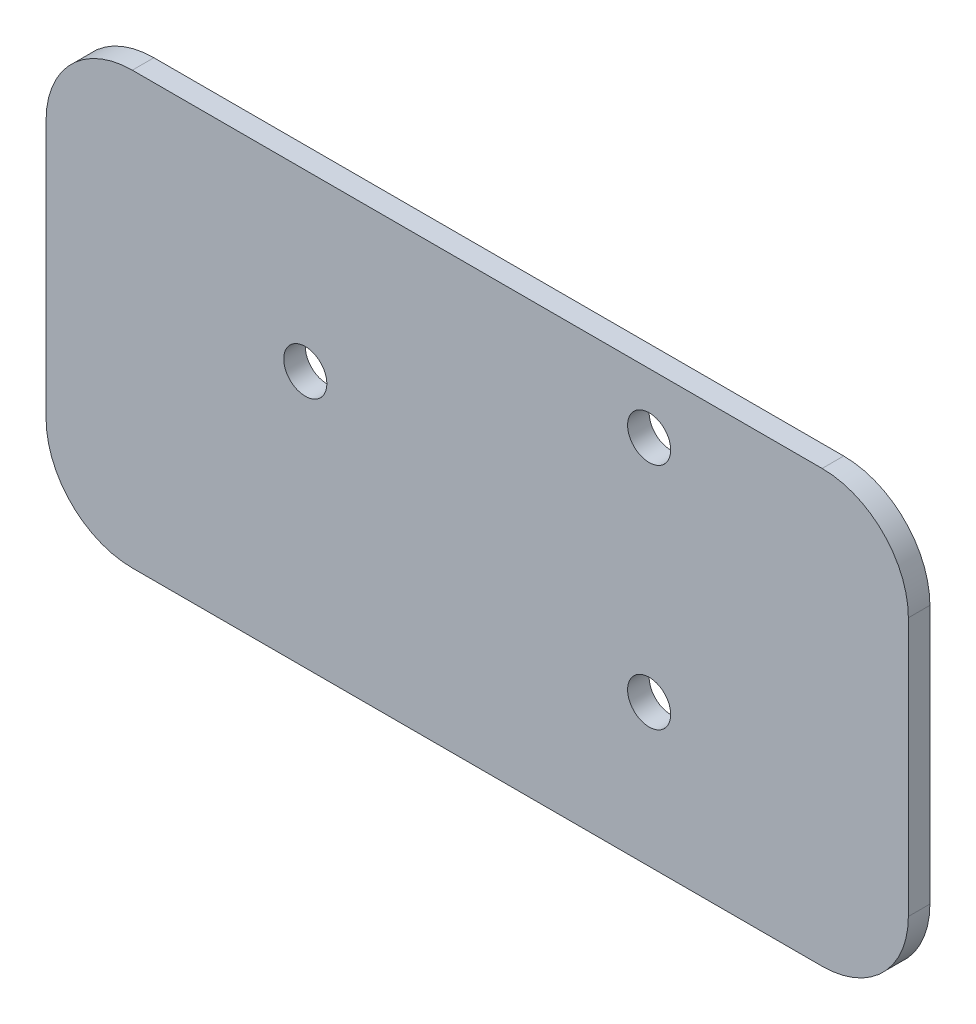
ISO-10303-21;
HEADER;
FILE_DESCRIPTION(('STEP AP214'),'2;1');
FILE_NAME('part.step','',(''),(''),'','','');
FILE_SCHEMA(('AUTOMOTIVE_DESIGN { 1 0 10303 214 1 1 1 1 }'));
ENDSEC;
DATA;
#1=APPLICATION_CONTEXT('core data for automotive mechanical design processes');
#2=APPLICATION_PROTOCOL_DEFINITION('international standard','automotive_design',2000,#1);
#3=PRODUCT_CONTEXT('',#1,'mechanical');
#4=PRODUCT('Part','Part','',(#3));
#5=PRODUCT_RELATED_PRODUCT_CATEGORY('part','',(#4));
#6=PRODUCT_DEFINITION_FORMATION('','',#4);
#7=PRODUCT_DEFINITION_CONTEXT('part definition',#1,'design');
#8=PRODUCT_DEFINITION('design','',#6,#7);
#9=PRODUCT_DEFINITION_SHAPE('','',#8);
#10=(LENGTH_UNIT() NAMED_UNIT(*) SI_UNIT(.MILLI.,.METRE.));
#11=(NAMED_UNIT(*) PLANE_ANGLE_UNIT() SI_UNIT($,.RADIAN.));
#12=(NAMED_UNIT(*) SI_UNIT($,.STERADIAN.) SOLID_ANGLE_UNIT());
#13=UNCERTAINTY_MEASURE_WITH_UNIT(LENGTH_MEASURE(1.E-05),#10,'distance_accuracy_value','');
#14=(GEOMETRIC_REPRESENTATION_CONTEXT(3) GLOBAL_UNCERTAINTY_ASSIGNED_CONTEXT((#13)) GLOBAL_UNIT_ASSIGNED_CONTEXT((#10,
#11,#12)) REPRESENTATION_CONTEXT('',''));
#15=CARTESIAN_POINT('',(0.,0.,0.));
#16=DIRECTION('',(0.,0.,1.));
#17=DIRECTION('',(1.,0.,0.));
#18=AXIS2_PLACEMENT_3D('',#15,#16,#17);
#19=CARTESIAN_POINT('',(0.,139.055716341249,3.175));
#20=DIRECTION('',(0.,1.,0.));
#21=DIRECTION('',(0.,0.,1.));
#22=AXIS2_PLACEMENT_3D('',#19,#20,#21);
#23=PLANE('',#22);
#24=DIRECTION('',(1.,0.,0.));
#25=VECTOR('',#24,1.);
#26=CARTESIAN_POINT('',(0.,139.055716341249,0.));
#27=LINE('',#26,#25);
#28=CARTESIAN_POINT('',(409.779351392055,139.055716341249,0.));
#29=VERTEX_POINT('',#28);
#30=CARTESIAN_POINT('',(511.379351392055,139.055716341249,0.));
#31=VERTEX_POINT('',#30);
#32=EDGE_CURVE('E138',#29,#31,#27,.T.);
#33=ORIENTED_EDGE('',*,*,#32,.F.);
#34=DIRECTION('',(0.,0.,-1.));
#35=VECTOR('',#34,1.);
#36=CARTESIAN_POINT('',(409.779351392055,139.055716341249,3.175));
#37=LINE('',#36,#35);
#38=CARTESIAN_POINT('',(409.779351392055,139.055716341249,3.175));
#39=VERTEX_POINT('',#38);
#40=EDGE_CURVE('E11',#39,#29,#37,.T.);
#41=ORIENTED_EDGE('',*,*,#40,.F.);
#42=DIRECTION('',(1.,0.,0.));
#43=VECTOR('',#42,1.);
#44=CARTESIAN_POINT('',(0.,139.055716341249,3.175));
#45=LINE('',#44,#43);
#46=CARTESIAN_POINT('',(511.379351392055,139.055716341249,3.175));
#47=VERTEX_POINT('',#46);
#48=EDGE_CURVE('E310',#39,#47,#45,.T.);
#49=ORIENTED_EDGE('',*,*,#48,.T.);
#50=DIRECTION('',(0.,0.,-1.));
#51=VECTOR('',#50,1.);
#52=CARTESIAN_POINT('',(511.379351392055,139.055716341249,3.175));
#53=LINE('',#52,#51);
#54=EDGE_CURVE('E52',#47,#31,#53,.T.);
#55=ORIENTED_EDGE('',*,*,#54,.T.);
#56=EDGE_LOOP('',(#33,#41,#49,#55));
#57=FACE_BOUND('',#56,.T.);
#58=ADVANCED_FACE('F35',(#57),#23,.T.);
#59=CARTESIAN_POINT('',(409.779351392055,126.355716341249,3.175));
#60=DIRECTION('',(0.,0.,-1.));
#61=DIRECTION('',(-1.,0.,0.));
#62=AXIS2_PLACEMENT_3D('',#59,#60,#61);
#63=CYLINDRICAL_SURFACE('',#62,12.7);
#64=CARTESIAN_POINT('',(409.779351392055,126.355716341249,0.));
#65=DIRECTION('',(0.,0.,1.));
#66=DIRECTION('',(1.,0.,0.));
#67=AXIS2_PLACEMENT_3D('',#64,#65,#66);
#68=CIRCLE('',#67,12.7);
#69=CARTESIAN_POINT('',(397.079351392055,126.355716341249,0.));
#70=VERTEX_POINT('',#69);
#71=EDGE_CURVE('E140',#29,#70,#68,.T.);
#72=ORIENTED_EDGE('',*,*,#71,.T.);
#73=DIRECTION('',(0.,0.,-1.));
#74=VECTOR('',#73,1.);
#75=CARTESIAN_POINT('',(397.079351392055,126.355716341249,3.175));
#76=LINE('',#75,#74);
#77=CARTESIAN_POINT('',(397.079351392055,126.355716341249,3.175));
#78=VERTEX_POINT('',#77);
#79=EDGE_CURVE('E44',#78,#70,#76,.T.);
#80=ORIENTED_EDGE('',*,*,#79,.F.);
#81=CARTESIAN_POINT('',(409.779351392055,126.355716341249,3.175));
#82=DIRECTION('',(0.,0.,1.));
#83=DIRECTION('',(1.,0.,0.));
#84=AXIS2_PLACEMENT_3D('',#81,#82,#83);
#85=CIRCLE('',#84,12.7);
#86=EDGE_CURVE('E306',#39,#78,#85,.T.);
#87=ORIENTED_EDGE('',*,*,#86,.F.);
#88=ORIENTED_EDGE('',*,*,#40,.T.);
#89=EDGE_LOOP('',(#72,#80,#87,#88));
#90=FACE_BOUND('',#89,.T.);
#91=ADVANCED_FACE('F177',(#90),#63,.T.);
#92=CARTESIAN_POINT('',(397.079351392055,5.78538895693811E-13,3.175));
#93=DIRECTION('',(1.,0.,0.));
#94=DIRECTION('',(0.,1.,0.));
#95=AXIS2_PLACEMENT_3D('',#92,#93,#94);
#96=PLANE('',#95);
#97=DIRECTION('',(0.,-1.,0.));
#98=VECTOR('',#97,1.);
#99=CARTESIAN_POINT('',(397.079351392055,5.78538895693811E-13,0.));
#100=LINE('',#99,#98);
#101=CARTESIAN_POINT('',(397.079351392055,88.2557163412488,0.));
#102=VERTEX_POINT('',#101);
#103=EDGE_CURVE('E143',#70,#102,#100,.T.);
#104=ORIENTED_EDGE('',*,*,#103,.T.);
#105=DIRECTION('',(0.,0.,-1.));
#106=VECTOR('',#105,1.);
#107=CARTESIAN_POINT('',(397.079351392055,88.2557163412488,3.175));
#108=LINE('',#107,#106);
#109=CARTESIAN_POINT('',(397.079351392055,88.2557163412488,3.175));
#110=VERTEX_POINT('',#109);
#111=EDGE_CURVE('E165',#110,#102,#108,.T.);
#112=ORIENTED_EDGE('',*,*,#111,.F.);
#113=DIRECTION('',(0.,-1.,0.));
#114=VECTOR('',#113,1.);
#115=CARTESIAN_POINT('',(397.079351392055,5.78538895693811E-13,3.175));
#116=LINE('',#115,#114);
#117=EDGE_CURVE('E173',#78,#110,#116,.T.);
#118=ORIENTED_EDGE('',*,*,#117,.F.);
#119=ORIENTED_EDGE('',*,*,#79,.T.);
#120=EDGE_LOOP('',(#104,#112,#118,#119));
#121=FACE_BOUND('',#120,.T.);
#122=ADVANCED_FACE('F170',(#121),#96,.F.);
#123=CARTESIAN_POINT('',(409.779351392055,88.2557163412488,3.175));
#124=DIRECTION('',(0.,0.,-1.));
#125=DIRECTION('',(-1.,0.,0.));
#126=AXIS2_PLACEMENT_3D('',#123,#124,#125);
#127=CYLINDRICAL_SURFACE('',#126,12.7);
#128=CARTESIAN_POINT('',(409.779351392055,88.2557163412488,0.));
#129=DIRECTION('',(0.,0.,1.));
#130=DIRECTION('',(1.,0.,0.));
#131=AXIS2_PLACEMENT_3D('',#128,#129,#130);
#132=CIRCLE('',#131,12.7);
#133=CARTESIAN_POINT('',(409.779351392055,75.5557163412488,0.));
#134=VERTEX_POINT('',#133);
#135=EDGE_CURVE('E146',#102,#134,#132,.T.);
#136=ORIENTED_EDGE('',*,*,#135,.T.);
#137=DIRECTION('',(0.,0.,-1.));
#138=VECTOR('',#137,1.);
#139=CARTESIAN_POINT('',(409.779351392055,75.5557163412488,3.175));
#140=LINE('',#139,#138);
#141=CARTESIAN_POINT('',(409.779351392055,75.5557163412488,3.175));
#142=VERTEX_POINT('',#141);
#143=EDGE_CURVE('E162',#142,#134,#140,.T.);
#144=ORIENTED_EDGE('',*,*,#143,.F.);
#145=CARTESIAN_POINT('',(409.779351392055,88.2557163412488,3.175));
#146=DIRECTION('',(0.,0.,1.));
#147=DIRECTION('',(1.,0.,0.));
#148=AXIS2_PLACEMENT_3D('',#145,#146,#147);
#149=CIRCLE('',#148,12.7);
#150=EDGE_CURVE('E304',#110,#142,#149,.T.);
#151=ORIENTED_EDGE('',*,*,#150,.F.);
#152=ORIENTED_EDGE('',*,*,#111,.T.);
#153=EDGE_LOOP('',(#136,#144,#151,#152));
#154=FACE_BOUND('',#153,.T.);
#155=ADVANCED_FACE('F226',(#154),#127,.T.);
#156=CARTESIAN_POINT('',(0.,75.5557163412487,3.175));
#157=DIRECTION('',(0.,1.,0.));
#158=DIRECTION('',(-1.,0.,0.));
#159=AXIS2_PLACEMENT_3D('',#156,#157,#158);
#160=PLANE('',#159);
#161=DIRECTION('',(1.,0.,0.));
#162=VECTOR('',#161,1.);
#163=CARTESIAN_POINT('',(0.,75.5557163412487,0.));
#164=LINE('',#163,#162);
#165=CARTESIAN_POINT('',(511.379351392055,75.5557163412488,0.));
#166=VERTEX_POINT('',#165);
#167=EDGE_CURVE('E149',#134,#166,#164,.T.);
#168=ORIENTED_EDGE('',*,*,#167,.T.);
#169=DIRECTION('',(0.,0.,-1.));
#170=VECTOR('',#169,1.);
#171=CARTESIAN_POINT('',(511.379351392055,75.5557163412488,3.175));
#172=LINE('',#171,#170);
#173=CARTESIAN_POINT('',(511.379351392055,75.5557163412488,3.175));
#174=VERTEX_POINT('',#173);
#175=EDGE_CURVE('E121',#174,#166,#172,.T.);
#176=ORIENTED_EDGE('',*,*,#175,.F.);
#177=DIRECTION('',(1.,0.,0.));
#178=VECTOR('',#177,1.);
#179=CARTESIAN_POINT('',(0.,75.5557163412487,3.175));
#180=LINE('',#179,#178);
#181=EDGE_CURVE('E110',#142,#174,#180,.T.);
#182=ORIENTED_EDGE('',*,*,#181,.F.);
#183=ORIENTED_EDGE('',*,*,#143,.T.);
#184=EDGE_LOOP('',(#168,#176,#182,#183));
#185=FACE_BOUND('',#184,.T.);
#186=ADVANCED_FACE('F223',(#185),#160,.F.);
#187=CARTESIAN_POINT('',(511.379351392055,88.2557163412488,3.175));
#188=DIRECTION('',(0.,0.,-1.));
#189=DIRECTION('',(-1.,0.,0.));
#190=AXIS2_PLACEMENT_3D('',#187,#188,#189);
#191=CYLINDRICAL_SURFACE('',#190,12.7);
#192=CARTESIAN_POINT('',(511.379351392055,88.2557163412488,0.));
#193=DIRECTION('',(0.,0.,1.));
#194=DIRECTION('',(1.,0.,0.));
#195=AXIS2_PLACEMENT_3D('',#192,#193,#194);
#196=CIRCLE('',#195,12.7);
#197=CARTESIAN_POINT('',(524.079351392055,88.2557163412488,0.));
#198=VERTEX_POINT('',#197);
#199=EDGE_CURVE('E118',#166,#198,#196,.T.);
#200=ORIENTED_EDGE('',*,*,#199,.T.);
#201=DIRECTION('',(0.,0.,-1.));
#202=VECTOR('',#201,1.);
#203=CARTESIAN_POINT('',(524.079351392055,88.2557163412488,3.175));
#204=LINE('',#203,#202);
#205=CARTESIAN_POINT('',(524.079351392055,88.2557163412488,3.175));
#206=VERTEX_POINT('',#205);
#207=EDGE_CURVE('E116',#206,#198,#204,.T.);
#208=ORIENTED_EDGE('',*,*,#207,.F.);
#209=CARTESIAN_POINT('',(511.379351392055,88.2557163412488,3.175));
#210=DIRECTION('',(0.,0.,1.));
#211=DIRECTION('',(1.,0.,0.));
#212=AXIS2_PLACEMENT_3D('',#209,#210,#211);
#213=CIRCLE('',#212,12.7);
#214=EDGE_CURVE('E102',#174,#206,#213,.T.);
#215=ORIENTED_EDGE('',*,*,#214,.F.);
#216=ORIENTED_EDGE('',*,*,#175,.T.);
#217=EDGE_LOOP('',(#200,#208,#215,#216));
#218=FACE_BOUND('',#217,.T.);
#219=ADVANCED_FACE('F117',(#218),#191,.T.);
#220=CARTESIAN_POINT('',(524.079351392055,0.,3.175));
#221=DIRECTION('',(1.,0.,0.));
#222=DIRECTION('',(0.,0.,-1.));
#223=AXIS2_PLACEMENT_3D('',#220,#221,#222);
#224=PLANE('',#223);
#225=DIRECTION('',(0.,-1.,0.));
#226=VECTOR('',#225,1.);
#227=CARTESIAN_POINT('',(524.079351392055,0.,0.));
#228=LINE('',#227,#226);
#229=CARTESIAN_POINT('',(524.079351392055,126.355716341249,0.));
#230=VERTEX_POINT('',#229);
#231=EDGE_CURVE('E153',#230,#198,#228,.T.);
#232=ORIENTED_EDGE('',*,*,#231,.F.);
#233=DIRECTION('',(0.,0.,-1.));
#234=VECTOR('',#233,1.);
#235=CARTESIAN_POINT('',(524.079351392055,126.355716341249,3.175));
#236=LINE('',#235,#234);
#237=CARTESIAN_POINT('',(524.079351392055,126.355716341249,3.175));
#238=VERTEX_POINT('',#237);
#239=EDGE_CURVE('E77',#238,#230,#236,.T.);
#240=ORIENTED_EDGE('',*,*,#239,.F.);
#241=DIRECTION('',(0.,-1.,0.));
#242=VECTOR('',#241,1.);
#243=CARTESIAN_POINT('',(524.079351392055,0.,3.175));
#244=LINE('',#243,#242);
#245=EDGE_CURVE('E108',#238,#206,#244,.T.);
#246=ORIENTED_EDGE('',*,*,#245,.T.);
#247=ORIENTED_EDGE('',*,*,#207,.T.);
#248=EDGE_LOOP('',(#232,#240,#246,#247));
#249=FACE_BOUND('',#248,.T.);
#250=ADVANCED_FACE('F123',(#249),#224,.T.);
#251=CARTESIAN_POINT('',(435.255534848016,113.379343598158,3.175));
#252=DIRECTION('',(0.,0.,-1.));
#253=DIRECTION('',(-1.,0.,0.));
#254=AXIS2_PLACEMENT_3D('',#251,#252,#253);
#255=CYLINDRICAL_SURFACE('',#254,3.17500000000009);
#256=CARTESIAN_POINT('',(435.255534848016,113.379343598158,3.175));
#257=DIRECTION('',(0.,0.,1.));
#258=DIRECTION('',(1.,0.,0.));
#259=AXIS2_PLACEMENT_3D('',#256,#257,#258);
#260=CIRCLE('',#259,3.17500000000009);
#261=CARTESIAN_POINT('',(438.430534848016,113.379343598158,3.175));
#262=VERTEX_POINT('',#261);
#263=EDGE_CURVE('E312',#262,#262,#260,.T.);
#264=ORIENTED_EDGE('',*,*,#263,.T.);
#265=EDGE_LOOP('',(#264));
#266=FACE_BOUND('',#265,.T.);
#267=CARTESIAN_POINT('',(435.255534848016,113.379343598158,0.));
#268=DIRECTION('',(0.,0.,1.));
#269=DIRECTION('',(1.,0.,0.));
#270=AXIS2_PLACEMENT_3D('',#267,#268,#269);
#271=CIRCLE('',#270,3.17500000000009);
#272=CARTESIAN_POINT('',(438.430534848016,113.379343598158,0.));
#273=VERTEX_POINT('',#272);
#274=EDGE_CURVE('E135',#273,#273,#271,.T.);
#275=ORIENTED_EDGE('',*,*,#274,.F.);
#276=EDGE_LOOP('',(#275));
#277=FACE_BOUND('',#276,.T.);
#278=ADVANCED_FACE('F188',(#266,#277),#255,.F.);
#279=CARTESIAN_POINT('',(485.903167936094,96.5107163412532,3.175));
#280=DIRECTION('',(0.,0.,-1.));
#281=DIRECTION('',(-1.,0.,0.));
#282=AXIS2_PLACEMENT_3D('',#279,#280,#281);
#283=CYLINDRICAL_SURFACE('',#282,3.17500000000009);
#284=CARTESIAN_POINT('',(485.903167936094,96.5107163412532,3.175));
#285=DIRECTION('',(0.,0.,1.));
#286=DIRECTION('',(1.,0.,0.));
#287=AXIS2_PLACEMENT_3D('',#284,#285,#286);
#288=CIRCLE('',#287,3.17500000000009);
#289=CARTESIAN_POINT('',(489.078167936094,96.5107163412532,3.175));
#290=VERTEX_POINT('',#289);
#291=EDGE_CURVE('E202',#290,#290,#288,.T.);
#292=ORIENTED_EDGE('',*,*,#291,.T.);
#293=EDGE_LOOP('',(#292));
#294=FACE_BOUND('',#293,.T.);
#295=CARTESIAN_POINT('',(485.903167936094,96.5107163412532,0.));
#296=DIRECTION('',(0.,0.,1.));
#297=DIRECTION('',(1.,0.,0.));
#298=AXIS2_PLACEMENT_3D('',#295,#296,#297);
#299=CIRCLE('',#298,3.17500000000009);
#300=CARTESIAN_POINT('',(489.078167936094,96.5107163412532,0.));
#301=VERTEX_POINT('',#300);
#302=EDGE_CURVE('E132',#301,#301,#299,.T.);
#303=ORIENTED_EDGE('',*,*,#302,.F.);
#304=EDGE_LOOP('',(#303));
#305=FACE_BOUND('',#304,.T.);
#306=ADVANCED_FACE('F190',(#294,#305),#283,.F.);
#307=CARTESIAN_POINT('',(485.903167936094,130.247970855064,3.175));
#308=DIRECTION('',(0.,0.,-1.));
#309=DIRECTION('',(-1.,0.,0.));
#310=AXIS2_PLACEMENT_3D('',#307,#308,#309);
#311=CYLINDRICAL_SURFACE('',#310,3.17500000000009);
#312=CARTESIAN_POINT('',(485.903167936094,130.247970855064,3.175));
#313=DIRECTION('',(0.,0.,1.));
#314=DIRECTION('',(1.,0.,0.));
#315=AXIS2_PLACEMENT_3D('',#312,#313,#314);
#316=CIRCLE('',#315,3.17500000000009);
#317=CARTESIAN_POINT('',(489.078167936094,130.247970855064,3.175));
#318=VERTEX_POINT('',#317);
#319=EDGE_CURVE('E158',#318,#318,#316,.T.);
#320=ORIENTED_EDGE('',*,*,#319,.T.);
#321=EDGE_LOOP('',(#320));
#322=FACE_BOUND('',#321,.T.);
#323=CARTESIAN_POINT('',(485.903167936094,130.247970855064,0.));
#324=DIRECTION('',(0.,0.,1.));
#325=DIRECTION('',(1.,0.,0.));
#326=AXIS2_PLACEMENT_3D('',#323,#324,#325);
#327=CIRCLE('',#326,3.17500000000009);
#328=CARTESIAN_POINT('',(489.078167936094,130.247970855064,0.));
#329=VERTEX_POINT('',#328);
#330=EDGE_CURVE('E129',#329,#329,#327,.T.);
#331=ORIENTED_EDGE('',*,*,#330,.F.);
#332=EDGE_LOOP('',(#331));
#333=FACE_BOUND('',#332,.T.);
#334=ADVANCED_FACE('F37',(#322,#333),#311,.F.);
#335=CARTESIAN_POINT('',(511.379351392055,126.355716341249,3.175));
#336=DIRECTION('',(0.,0.,-1.));
#337=DIRECTION('',(-1.,0.,0.));
#338=AXIS2_PLACEMENT_3D('',#335,#336,#337);
#339=CYLINDRICAL_SURFACE('',#338,12.7);
#340=CARTESIAN_POINT('',(511.379351392055,126.355716341249,0.));
#341=DIRECTION('',(0.,0.,1.));
#342=DIRECTION('',(1.,0.,0.));
#343=AXIS2_PLACEMENT_3D('',#340,#341,#342);
#344=CIRCLE('',#343,12.7);
#345=EDGE_CURVE('E155',#31,#230,#344,.F.);
#346=ORIENTED_EDGE('',*,*,#345,.F.);
#347=ORIENTED_EDGE('',*,*,#54,.F.);
#348=CARTESIAN_POINT('',(511.379351392055,126.355716341249,3.175));
#349=DIRECTION('',(0.,0.,1.));
#350=DIRECTION('',(1.,0.,0.));
#351=AXIS2_PLACEMENT_3D('',#348,#349,#350);
#352=CIRCLE('',#351,12.7);
#353=EDGE_CURVE('E124',#47,#238,#352,.F.);
#354=ORIENTED_EDGE('',*,*,#353,.T.);
#355=ORIENTED_EDGE('',*,*,#239,.T.);
#356=EDGE_LOOP('',(#346,#347,#354,#355));
#357=FACE_BOUND('',#356,.T.);
#358=ADVANCED_FACE('F197',(#357),#339,.T.);
#359=CARTESIAN_POINT('',(0.,0.,3.175));
#360=DIRECTION('',(0.,0.,1.));
#361=DIRECTION('',(1.,0.,0.));
#362=AXIS2_PLACEMENT_3D('',#359,#360,#361);
#363=PLANE('',#362);
#364=ORIENTED_EDGE('',*,*,#319,.F.);
#365=EDGE_LOOP('',(#364));
#366=FACE_BOUND('',#365,.T.);
#367=ORIENTED_EDGE('',*,*,#291,.F.);
#368=EDGE_LOOP('',(#367));
#369=FACE_BOUND('',#368,.T.);
#370=ORIENTED_EDGE('',*,*,#263,.F.);
#371=EDGE_LOOP('',(#370));
#372=FACE_BOUND('',#371,.T.);
#373=ORIENTED_EDGE('',*,*,#48,.F.);
#374=ORIENTED_EDGE('',*,*,#86,.T.);
#375=ORIENTED_EDGE('',*,*,#117,.T.);
#376=ORIENTED_EDGE('',*,*,#150,.T.);
#377=ORIENTED_EDGE('',*,*,#181,.T.);
#378=ORIENTED_EDGE('',*,*,#214,.T.);
#379=ORIENTED_EDGE('',*,*,#245,.F.);
#380=ORIENTED_EDGE('',*,*,#353,.F.);
#381=EDGE_LOOP('',(#373,#374,#375,#376,#377,#378,#379,#380));
#382=FACE_BOUND('',#381,.T.);
#383=ADVANCED_FACE('F105',(#366,#369,#372,#382),#363,.T.);
#384=CARTESIAN_POINT('',(0.,0.,0.));
#385=DIRECTION('',(0.,0.,1.));
#386=DIRECTION('',(1.,0.,0.));
#387=AXIS2_PLACEMENT_3D('',#384,#385,#386);
#388=PLANE('',#387);
#389=ORIENTED_EDGE('',*,*,#330,.T.);
#390=EDGE_LOOP('',(#389));
#391=FACE_BOUND('',#390,.T.);
#392=ORIENTED_EDGE('',*,*,#302,.T.);
#393=EDGE_LOOP('',(#392));
#394=FACE_BOUND('',#393,.T.);
#395=ORIENTED_EDGE('',*,*,#274,.T.);
#396=EDGE_LOOP('',(#395));
#397=FACE_BOUND('',#396,.T.);
#398=ORIENTED_EDGE('',*,*,#32,.T.);
#399=ORIENTED_EDGE('',*,*,#345,.T.);
#400=ORIENTED_EDGE('',*,*,#231,.T.);
#401=ORIENTED_EDGE('',*,*,#199,.F.);
#402=ORIENTED_EDGE('',*,*,#167,.F.);
#403=ORIENTED_EDGE('',*,*,#135,.F.);
#404=ORIENTED_EDGE('',*,*,#103,.F.);
#405=ORIENTED_EDGE('',*,*,#71,.F.);
#406=EDGE_LOOP('',(#398,#399,#400,#401,#402,#403,#404,#405));
#407=FACE_BOUND('',#406,.T.);
#408=ADVANCED_FACE('F179',(#391,#394,#397,#407),#388,.F.);
#409=CLOSED_SHELL('',(#58,#91,#122,#155,#186,#219,#250,#278,#306,#334,#358,#383,#408));
#410=MANIFOLD_SOLID_BREP('B2',#409);
#411=ADVANCED_BREP_SHAPE_REPRESENTATION('',(#18,#410),#14);
#412=SHAPE_DEFINITION_REPRESENTATION(#9,#411);
ENDSEC;
END-ISO-10303-21;
